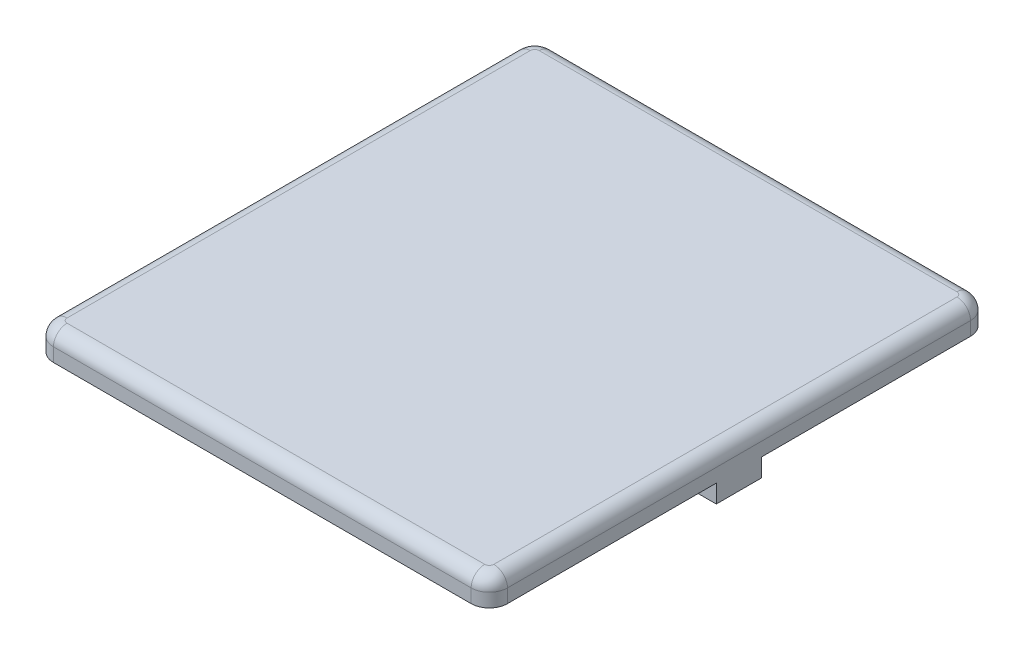
ISO-10303-21;
HEADER;
FILE_DESCRIPTION(('STEP AP214'),'2;1');
FILE_NAME('part.step','',(''),(''),'','','');
FILE_SCHEMA(('AUTOMOTIVE_DESIGN { 1 0 10303 214 1 1 1 1 }'));
ENDSEC;
DATA;
#1=APPLICATION_CONTEXT('core data for automotive mechanical design processes');
#2=APPLICATION_PROTOCOL_DEFINITION('international standard','automotive_design',2000,#1);
#3=PRODUCT_CONTEXT('',#1,'mechanical');
#4=PRODUCT('Part','Part','',(#3));
#5=PRODUCT_RELATED_PRODUCT_CATEGORY('part','',(#4));
#6=PRODUCT_DEFINITION_FORMATION('','',#4);
#7=PRODUCT_DEFINITION_CONTEXT('part definition',#1,'design');
#8=PRODUCT_DEFINITION('design','',#6,#7);
#9=PRODUCT_DEFINITION_SHAPE('','',#8);
#10=(LENGTH_UNIT() NAMED_UNIT(*) SI_UNIT(.MILLI.,.METRE.));
#11=(NAMED_UNIT(*) PLANE_ANGLE_UNIT() SI_UNIT($,.RADIAN.));
#12=(NAMED_UNIT(*) SI_UNIT($,.STERADIAN.) SOLID_ANGLE_UNIT());
#13=UNCERTAINTY_MEASURE_WITH_UNIT(LENGTH_MEASURE(1.E-05),#10,'distance_accuracy_value','');
#14=(GEOMETRIC_REPRESENTATION_CONTEXT(3) GLOBAL_UNCERTAINTY_ASSIGNED_CONTEXT((#13)) GLOBAL_UNIT_ASSIGNED_CONTEXT((#10,
#11,#12)) REPRESENTATION_CONTEXT('',''));
#15=CARTESIAN_POINT('',(0.,0.,0.));
#16=DIRECTION('',(0.,0.,1.));
#17=DIRECTION('',(1.,0.,0.));
#18=AXIS2_PLACEMENT_3D('',#15,#16,#17);
#19=CARTESIAN_POINT('',(0.,-2.,-2.5));
#20=DIRECTION('',(0.,0.,1.));
#21=DIRECTION('',(1.,0.,0.));
#22=AXIS2_PLACEMENT_3D('',#19,#20,#21);
#23=PLANE('',#22);
#24=DIRECTION('',(0.,1.,0.));
#25=VECTOR('',#24,1.);
#26=CARTESIAN_POINT('',(31.,-5.,-2.5));
#27=LINE('',#26,#25);
#28=CARTESIAN_POINT('',(31.,0.,-2.5));
#29=VERTEX_POINT('',#28);
#30=CARTESIAN_POINT('',(31.,-2.,-2.5));
#31=VERTEX_POINT('',#30);
#32=EDGE_CURVE('E57',#29,#31,#27,.F.);
#33=ORIENTED_EDGE('',*,*,#32,.F.);
#34=DIRECTION('',(1.,0.,0.));
#35=VECTOR('',#34,1.);
#36=CARTESIAN_POINT('',(0.,0.,-2.5));
#37=LINE('',#36,#35);
#38=CARTESIAN_POINT('',(50.,0.,-2.5));
#39=VERTEX_POINT('',#38);
#40=EDGE_CURVE('E192',#29,#39,#37,.T.);
#41=ORIENTED_EDGE('',*,*,#40,.T.);
#42=DIRECTION('',(0.,1.,0.));
#43=VECTOR('',#42,1.);
#44=CARTESIAN_POINT('',(50.,-2.,-2.5));
#45=LINE('',#44,#43);
#46=CARTESIAN_POINT('',(50.,-2.,-2.5));
#47=VERTEX_POINT('',#46);
#48=EDGE_CURVE('E218',#47,#39,#45,.T.);
#49=ORIENTED_EDGE('',*,*,#48,.F.);
#50=DIRECTION('',(1.,0.,0.));
#51=VECTOR('',#50,1.);
#52=CARTESIAN_POINT('',(0.,-2.,-2.5));
#53=LINE('',#52,#51);
#54=EDGE_CURVE('E194',#31,#47,#53,.T.);
#55=ORIENTED_EDGE('',*,*,#54,.F.);
#56=EDGE_LOOP('',(#33,#41,#49,#55));
#57=FACE_BOUND('',#56,.T.);
#58=ADVANCED_FACE('F42',(#57),#23,.F.);
#59=DIRECTION('',(0.,1.,0.));
#60=VECTOR('',#59,1.);
#61=CARTESIAN_POINT('',(19.,-5.,-2.5));
#62=LINE('',#61,#60);
#63=CARTESIAN_POINT('',(19.,-2.,-2.5));
#64=VERTEX_POINT('',#63);
#65=CARTESIAN_POINT('',(19.,0.,-2.5));
#66=VERTEX_POINT('',#65);
#67=EDGE_CURVE('E182',#64,#66,#62,.T.);
#68=ORIENTED_EDGE('',*,*,#67,.F.);
#69=CARTESIAN_POINT('',(0.,-2.,-2.5));
#70=VERTEX_POINT('',#69);
#71=EDGE_CURVE('E350',#70,#64,#53,.T.);
#72=ORIENTED_EDGE('',*,*,#71,.F.);
#73=DIRECTION('',(0.,1.,0.));
#74=VECTOR('',#73,1.);
#75=CARTESIAN_POINT('',(0.,-2.,-2.5));
#76=LINE('',#75,#74);
#77=CARTESIAN_POINT('',(0.,0.,-2.5));
#78=VERTEX_POINT('',#77);
#79=EDGE_CURVE('E220',#70,#78,#76,.T.);
#80=ORIENTED_EDGE('',*,*,#79,.T.);
#81=EDGE_CURVE('E202',#78,#66,#37,.T.);
#82=ORIENTED_EDGE('',*,*,#81,.T.);
#83=EDGE_LOOP('',(#68,#72,#80,#82));
#84=FACE_BOUND('',#83,.T.);
#85=ADVANCED_FACE('F377',(#84),#23,.F.);
#86=CARTESIAN_POINT('',(0.,-2.,2.5));
#87=DIRECTION('',(0.,0.,-1.));
#88=DIRECTION('',(-1.,0.,0.));
#89=AXIS2_PLACEMENT_3D('',#86,#87,#88);
#90=PLANE('',#89);
#91=DIRECTION('',(0.,1.,0.));
#92=VECTOR('',#91,1.);
#93=CARTESIAN_POINT('',(19.,-5.,2.5));
#94=LINE('',#93,#92);
#95=CARTESIAN_POINT('',(19.,0.,2.5));
#96=VERTEX_POINT('',#95);
#97=CARTESIAN_POINT('',(19.,-2.,2.5));
#98=VERTEX_POINT('',#97);
#99=EDGE_CURVE('E195',#96,#98,#94,.F.);
#100=ORIENTED_EDGE('',*,*,#99,.F.);
#101=DIRECTION('',(-1.,0.,0.));
#102=VECTOR('',#101,1.);
#103=CARTESIAN_POINT('',(0.,0.,2.5));
#104=LINE('',#103,#102);
#105=CARTESIAN_POINT('',(0.,0.,2.5));
#106=VERTEX_POINT('',#105);
#107=EDGE_CURVE('E204',#96,#106,#104,.T.);
#108=ORIENTED_EDGE('',*,*,#107,.T.);
#109=DIRECTION('',(0.,1.,0.));
#110=VECTOR('',#109,1.);
#111=CARTESIAN_POINT('',(0.,-2.,2.5));
#112=LINE('',#111,#110);
#113=CARTESIAN_POINT('',(0.,-2.,2.5));
#114=VERTEX_POINT('',#113);
#115=EDGE_CURVE('E212',#114,#106,#112,.T.);
#116=ORIENTED_EDGE('',*,*,#115,.F.);
#117=DIRECTION('',(-1.,0.,0.));
#118=VECTOR('',#117,1.);
#119=CARTESIAN_POINT('',(0.,-2.,2.5));
#120=LINE('',#119,#118);
#121=EDGE_CURVE('E353',#98,#114,#120,.T.);
#122=ORIENTED_EDGE('',*,*,#121,.F.);
#123=EDGE_LOOP('',(#100,#108,#116,#122));
#124=FACE_BOUND('',#123,.T.);
#125=ADVANCED_FACE('F372',(#124),#90,.F.);
#126=DIRECTION('',(0.,1.,0.));
#127=VECTOR('',#126,1.);
#128=CARTESIAN_POINT('',(31.,-5.,2.5));
#129=LINE('',#128,#127);
#130=CARTESIAN_POINT('',(31.,-2.,2.5));
#131=VERTEX_POINT('',#130);
#132=CARTESIAN_POINT('',(31.,0.,2.5));
#133=VERTEX_POINT('',#132);
#134=EDGE_CURVE('E196',#131,#133,#129,.T.);
#135=ORIENTED_EDGE('',*,*,#134,.F.);
#136=CARTESIAN_POINT('',(50.,-2.,2.5));
#137=VERTEX_POINT('',#136);
#138=EDGE_CURVE('E208',#137,#131,#120,.T.);
#139=ORIENTED_EDGE('',*,*,#138,.F.);
#140=DIRECTION('',(0.,1.,0.));
#141=VECTOR('',#140,1.);
#142=CARTESIAN_POINT('',(50.,-2.,2.5));
#143=LINE('',#142,#141);
#144=CARTESIAN_POINT('',(50.,0.,2.5));
#145=VERTEX_POINT('',#144);
#146=EDGE_CURVE('E215',#137,#145,#143,.T.);
#147=ORIENTED_EDGE('',*,*,#146,.T.);
#148=EDGE_CURVE('E65',#145,#133,#104,.T.);
#149=ORIENTED_EDGE('',*,*,#148,.T.);
#150=EDGE_LOOP('',(#135,#139,#147,#149));
#151=FACE_BOUND('',#150,.T.);
#152=ADVANCED_FACE('F366',(#151),#90,.F.);
#153=CARTESIAN_POINT('',(0.,-2.,0.));
#154=DIRECTION('',(0.,-1.,0.));
#155=DIRECTION('',(0.,0.,-1.));
#156=AXIS2_PLACEMENT_3D('',#153,#154,#155);
#157=PLANE('',#156);
#158=ORIENTED_EDGE('',*,*,#71,.T.);
#159=CARTESIAN_POINT('',(25.,-2.,0.));
#160=DIRECTION('',(0.,-1.,0.));
#161=DIRECTION('',(0.,0.,-1.));
#162=AXIS2_PLACEMENT_3D('',#159,#160,#161);
#163=CIRCLE('',#162,6.5);
#164=EDGE_CURVE('E322',#64,#98,#163,.F.);
#165=ORIENTED_EDGE('',*,*,#164,.T.);
#166=ORIENTED_EDGE('',*,*,#121,.T.);
#167=DIRECTION('',(0.,0.,-1.));
#168=VECTOR('',#167,1.);
#169=CARTESIAN_POINT('',(0.,-2.,2.5));
#170=LINE('',#169,#168);
#171=EDGE_CURVE('E211',#114,#70,#170,.T.);
#172=ORIENTED_EDGE('',*,*,#171,.T.);
#173=EDGE_LOOP('',(#158,#165,#166,#172));
#174=FACE_BOUND('',#173,.T.);
#175=ADVANCED_FACE('F374',(#174),#157,.T.);
#176=CARTESIAN_POINT('',(0.,0.,27.5));
#177=DIRECTION('',(0.,1.,0.));
#178=DIRECTION('',(0.,0.,1.));
#179=AXIS2_PLACEMENT_3D('',#176,#177,#178);
#180=PLANE('',#179);
#181=CARTESIAN_POINT('',(25.,0.,0.));
#182=DIRECTION('',(0.,-1.,0.));
#183=DIRECTION('',(0.,0.,-1.));
#184=AXIS2_PLACEMENT_3D('',#181,#182,#183);
#185=CIRCLE('',#184,6.5);
#186=EDGE_CURVE('E186',#133,#96,#185,.T.);
#187=ORIENTED_EDGE('',*,*,#186,.F.);
#188=ORIENTED_EDGE('',*,*,#148,.F.);
#189=DIRECTION('',(0.,0.,-1.));
#190=VECTOR('',#189,1.);
#191=CARTESIAN_POINT('',(50.,0.,27.5));
#192=LINE('',#191,#190);
#193=CARTESIAN_POINT('',(50.,0.,25.5));
#194=VERTEX_POINT('',#193);
#195=EDGE_CURVE('E231',#194,#145,#192,.T.);
#196=ORIENTED_EDGE('',*,*,#195,.F.);
#197=CARTESIAN_POINT('',(48.,0.,25.5));
#198=DIRECTION('',(0.,1.,0.));
#199=DIRECTION('',(0.,0.,1.));
#200=AXIS2_PLACEMENT_3D('',#197,#198,#199);
#201=CIRCLE('',#200,2.);
#202=CARTESIAN_POINT('',(48.,0.,27.5));
#203=VERTEX_POINT('',#202);
#204=EDGE_CURVE('E245',#194,#203,#201,.F.);
#205=ORIENTED_EDGE('',*,*,#204,.T.);
#206=DIRECTION('',(1.,0.,0.));
#207=VECTOR('',#206,1.);
#208=CARTESIAN_POINT('',(0.,0.,27.5));
#209=LINE('',#208,#207);
#210=CARTESIAN_POINT('',(2.,0.,27.5));
#211=VERTEX_POINT('',#210);
#212=EDGE_CURVE('E224',#211,#203,#209,.T.);
#213=ORIENTED_EDGE('',*,*,#212,.F.);
#214=CARTESIAN_POINT('',(2.,0.,25.5));
#215=DIRECTION('',(0.,1.,0.));
#216=DIRECTION('',(0.,0.,1.));
#217=AXIS2_PLACEMENT_3D('',#214,#215,#216);
#218=CIRCLE('',#217,2.);
#219=CARTESIAN_POINT('',(0.,0.,25.5));
#220=VERTEX_POINT('',#219);
#221=EDGE_CURVE('E243',#211,#220,#218,.F.);
#222=ORIENTED_EDGE('',*,*,#221,.T.);
#223=DIRECTION('',(0.,0.,-1.));
#224=VECTOR('',#223,1.);
#225=CARTESIAN_POINT('',(0.,0.,27.5));
#226=LINE('',#225,#224);
#227=EDGE_CURVE('E234',#220,#106,#226,.T.);
#228=ORIENTED_EDGE('',*,*,#227,.T.);
#229=ORIENTED_EDGE('',*,*,#107,.F.);
#230=EDGE_LOOP('',(#187,#188,#196,#205,#213,#222,#228,#229));
#231=FACE_BOUND('',#230,.T.);
#232=ADVANCED_FACE('F369',(#231),#180,.F.);
#233=EDGE_CURVE('E179',#66,#29,#185,.T.);
#234=ORIENTED_EDGE('',*,*,#233,.F.);
#235=ORIENTED_EDGE('',*,*,#81,.F.);
#236=CARTESIAN_POINT('',(0.,0.,-25.5));
#237=VERTEX_POINT('',#236);
#238=EDGE_CURVE('E233',#78,#237,#226,.T.);
#239=ORIENTED_EDGE('',*,*,#238,.T.);
#240=CARTESIAN_POINT('',(2.,0.,-25.5));
#241=DIRECTION('',(0.,1.,0.));
#242=DIRECTION('',(0.,0.,1.));
#243=AXIS2_PLACEMENT_3D('',#240,#241,#242);
#244=CIRCLE('',#243,2.);
#245=CARTESIAN_POINT('',(2.,0.,-27.5));
#246=VERTEX_POINT('',#245);
#247=EDGE_CURVE('E249',#237,#246,#244,.F.);
#248=ORIENTED_EDGE('',*,*,#247,.T.);
#249=DIRECTION('',(1.,0.,0.));
#250=VECTOR('',#249,1.);
#251=CARTESIAN_POINT('',(0.,0.,-27.5));
#252=LINE('',#251,#250);
#253=CARTESIAN_POINT('',(48.,0.,-27.5));
#254=VERTEX_POINT('',#253);
#255=EDGE_CURVE('E227',#246,#254,#252,.T.);
#256=ORIENTED_EDGE('',*,*,#255,.T.);
#257=CARTESIAN_POINT('',(48.,0.,-25.5));
#258=DIRECTION('',(0.,1.,0.));
#259=DIRECTION('',(0.,0.,1.));
#260=AXIS2_PLACEMENT_3D('',#257,#258,#259);
#261=CIRCLE('',#260,2.);
#262=CARTESIAN_POINT('',(50.,0.,-25.5));
#263=VERTEX_POINT('',#262);
#264=EDGE_CURVE('E247',#254,#263,#261,.F.);
#265=ORIENTED_EDGE('',*,*,#264,.T.);
#266=EDGE_CURVE('E200',#39,#263,#192,.T.);
#267=ORIENTED_EDGE('',*,*,#266,.F.);
#268=ORIENTED_EDGE('',*,*,#40,.F.);
#269=EDGE_LOOP('',(#234,#235,#239,#248,#256,#265,#267,#268));
#270=FACE_BOUND('',#269,.T.);
#271=ADVANCED_FACE('F198',(#270),#180,.F.);
#272=CARTESIAN_POINT('',(0.,0.,27.5));
#273=DIRECTION('',(1.,0.,0.));
#274=DIRECTION('',(0.,0.,-1.));
#275=AXIS2_PLACEMENT_3D('',#272,#273,#274);
#276=PLANE('',#275);
#277=DIRECTION('',(0.,-1.,0.));
#278=VECTOR('',#277,1.);
#279=CARTESIAN_POINT('',(0.,0.,25.5));
#280=LINE('',#279,#278);
#281=CARTESIAN_POINT('',(0.,1.5,25.5));
#282=VERTEX_POINT('',#281);
#283=EDGE_CURVE('E237',#220,#282,#280,.F.);
#284=ORIENTED_EDGE('',*,*,#283,.T.);
#285=DIRECTION('',(0.,0.,-1.));
#286=VECTOR('',#285,1.);
#287=CARTESIAN_POINT('',(0.,1.5,27.5));
#288=LINE('',#287,#286);
#289=CARTESIAN_POINT('',(0.,1.5,-25.5));
#290=VERTEX_POINT('',#289);
#291=EDGE_CURVE('E294',#282,#290,#288,.T.);
#292=ORIENTED_EDGE('',*,*,#291,.T.);
#293=DIRECTION('',(0.,-1.,0.));
#294=VECTOR('',#293,1.);
#295=CARTESIAN_POINT('',(0.,0.,-25.5));
#296=LINE('',#295,#294);
#297=EDGE_CURVE('E240',#290,#237,#296,.T.);
#298=ORIENTED_EDGE('',*,*,#297,.T.);
#299=ORIENTED_EDGE('',*,*,#238,.F.);
#300=ORIENTED_EDGE('',*,*,#79,.F.);
#301=ORIENTED_EDGE('',*,*,#171,.F.);
#302=ORIENTED_EDGE('',*,*,#115,.T.);
#303=ORIENTED_EDGE('',*,*,#227,.F.);
#304=EDGE_LOOP('',(#284,#292,#298,#299,#300,#301,#302,#303));
#305=FACE_BOUND('',#304,.T.);
#306=ADVANCED_FACE('F380',(#305),#276,.F.);
#307=CARTESIAN_POINT('',(50.,0.,27.5));
#308=DIRECTION('',(-1.,0.,0.));
#309=DIRECTION('',(0.,0.,1.));
#310=AXIS2_PLACEMENT_3D('',#307,#308,#309);
#311=PLANE('',#310);
#312=DIRECTION('',(0.,1.,0.));
#313=VECTOR('',#312,1.);
#314=CARTESIAN_POINT('',(50.,3.,-25.5));
#315=LINE('',#314,#313);
#316=CARTESIAN_POINT('',(50.,1.5,-25.5));
#317=VERTEX_POINT('',#316);
#318=EDGE_CURVE('E258',#263,#317,#315,.T.);
#319=ORIENTED_EDGE('',*,*,#318,.T.);
#320=DIRECTION('',(0.,0.,-1.));
#321=VECTOR('',#320,1.);
#322=CARTESIAN_POINT('',(50.,1.5,27.5));
#323=LINE('',#322,#321);
#324=CARTESIAN_POINT('',(50.,1.5,25.5));
#325=VERTEX_POINT('',#324);
#326=EDGE_CURVE('E286',#317,#325,#323,.F.);
#327=ORIENTED_EDGE('',*,*,#326,.T.);
#328=DIRECTION('',(0.,1.,0.));
#329=VECTOR('',#328,1.);
#330=CARTESIAN_POINT('',(50.,0.,25.5));
#331=LINE('',#330,#329);
#332=EDGE_CURVE('E256',#325,#194,#331,.F.);
#333=ORIENTED_EDGE('',*,*,#332,.T.);
#334=ORIENTED_EDGE('',*,*,#195,.T.);
#335=ORIENTED_EDGE('',*,*,#146,.F.);
#336=DIRECTION('',(0.,0.,1.));
#337=VECTOR('',#336,1.);
#338=CARTESIAN_POINT('',(50.,-2.,2.5));
#339=LINE('',#338,#337);
#340=EDGE_CURVE('E352',#47,#137,#339,.T.);
#341=ORIENTED_EDGE('',*,*,#340,.F.);
#342=ORIENTED_EDGE('',*,*,#48,.T.);
#343=ORIENTED_EDGE('',*,*,#266,.T.);
#344=EDGE_LOOP('',(#319,#327,#333,#334,#335,#341,#342,#343));
#345=FACE_BOUND('',#344,.T.);
#346=ADVANCED_FACE('F418',(#345),#311,.F.);
#347=CARTESIAN_POINT('',(0.,3.,27.5));
#348=DIRECTION('',(0.,-1.,0.));
#349=DIRECTION('',(0.,0.,-1.));
#350=AXIS2_PLACEMENT_3D('',#347,#348,#349);
#351=PLANE('',#350);
#352=DIRECTION('',(0.,0.,-1.));
#353=VECTOR('',#352,1.);
#354=CARTESIAN_POINT('',(48.5,3.,27.5));
#355=LINE('',#354,#353);
#356=CARTESIAN_POINT('',(48.5,3.,25.5));
#357=VERTEX_POINT('',#356);
#358=CARTESIAN_POINT('',(48.5,3.,-25.5));
#359=VERTEX_POINT('',#358);
#360=EDGE_CURVE('E278',#357,#359,#355,.T.);
#361=ORIENTED_EDGE('',*,*,#360,.T.);
#362=CARTESIAN_POINT('',(48.,3.,-25.5));
#363=DIRECTION('',(0.,-1.,0.));
#364=DIRECTION('',(0.,0.,-1.));
#365=AXIS2_PLACEMENT_3D('',#362,#363,#364);
#366=CIRCLE('',#365,0.5);
#367=CARTESIAN_POINT('',(48.,3.,-26.));
#368=VERTEX_POINT('',#367);
#369=EDGE_CURVE('E280',#359,#368,#366,.F.);
#370=ORIENTED_EDGE('',*,*,#369,.T.);
#371=DIRECTION('',(-1.,0.,0.));
#372=VECTOR('',#371,1.);
#373=CARTESIAN_POINT('',(2.,3.,-26.));
#374=LINE('',#373,#372);
#375=CARTESIAN_POINT('',(2.,3.,-26.));
#376=VERTEX_POINT('',#375);
#377=EDGE_CURVE('E266',#368,#376,#374,.T.);
#378=ORIENTED_EDGE('',*,*,#377,.T.);
#379=CARTESIAN_POINT('',(2.,3.,-25.5));
#380=DIRECTION('',(0.,-1.,0.));
#381=DIRECTION('',(0.,0.,-1.));
#382=AXIS2_PLACEMENT_3D('',#379,#380,#381);
#383=CIRCLE('',#382,0.5);
#384=CARTESIAN_POINT('',(1.5,3.,-25.5));
#385=VERTEX_POINT('',#384);
#386=EDGE_CURVE('E268',#376,#385,#383,.F.);
#387=ORIENTED_EDGE('',*,*,#386,.T.);
#388=DIRECTION('',(0.,0.,-1.));
#389=VECTOR('',#388,1.);
#390=CARTESIAN_POINT('',(1.5,3.,27.5));
#391=LINE('',#390,#389);
#392=CARTESIAN_POINT('',(1.5,3.,25.5));
#393=VERTEX_POINT('',#392);
#394=EDGE_CURVE('E270',#385,#393,#391,.F.);
#395=ORIENTED_EDGE('',*,*,#394,.T.);
#396=CARTESIAN_POINT('',(2.,3.,25.5));
#397=DIRECTION('',(0.,-1.,0.));
#398=DIRECTION('',(0.,0.,-1.));
#399=AXIS2_PLACEMENT_3D('',#396,#397,#398);
#400=CIRCLE('',#399,0.5);
#401=CARTESIAN_POINT('',(2.,3.,26.));
#402=VERTEX_POINT('',#401);
#403=EDGE_CURVE('E272',#393,#402,#400,.F.);
#404=ORIENTED_EDGE('',*,*,#403,.T.);
#405=DIRECTION('',(-1.,0.,0.));
#406=VECTOR('',#405,1.);
#407=CARTESIAN_POINT('',(0.,3.,26.));
#408=LINE('',#407,#406);
#409=CARTESIAN_POINT('',(48.,3.,26.));
#410=VERTEX_POINT('',#409);
#411=EDGE_CURVE('E274',#402,#410,#408,.F.);
#412=ORIENTED_EDGE('',*,*,#411,.T.);
#413=CARTESIAN_POINT('',(48.,3.,25.5));
#414=DIRECTION('',(0.,-1.,0.));
#415=DIRECTION('',(0.,0.,-1.));
#416=AXIS2_PLACEMENT_3D('',#413,#414,#415);
#417=CIRCLE('',#416,0.5);
#418=EDGE_CURVE('E276',#410,#357,#417,.F.);
#419=ORIENTED_EDGE('',*,*,#418,.T.);
#420=EDGE_LOOP('',(#361,#370,#378,#387,#395,#404,#412,#419));
#421=FACE_BOUND('',#420,.T.);
#422=ADVANCED_FACE('F410',(#421),#351,.F.);
#423=CARTESIAN_POINT('',(0.,0.,27.5));
#424=DIRECTION('',(0.,0.,-1.));
#425=DIRECTION('',(-1.,0.,0.));
#426=AXIS2_PLACEMENT_3D('',#423,#424,#425);
#427=PLANE('',#426);
#428=DIRECTION('',(0.,1.,0.));
#429=VECTOR('',#428,1.);
#430=CARTESIAN_POINT('',(48.,0.,27.5));
#431=LINE('',#430,#429);
#432=CARTESIAN_POINT('',(48.,1.5,27.5));
#433=VERTEX_POINT('',#432);
#434=EDGE_CURVE('E263',#203,#433,#431,.T.);
#435=ORIENTED_EDGE('',*,*,#434,.T.);
#436=DIRECTION('',(-1.,0.,0.));
#437=VECTOR('',#436,1.);
#438=CARTESIAN_POINT('',(0.,1.5,27.5));
#439=LINE('',#438,#437);
#440=CARTESIAN_POINT('',(2.,1.5,27.5));
#441=VERTEX_POINT('',#440);
#442=EDGE_CURVE('E290',#433,#441,#439,.T.);
#443=ORIENTED_EDGE('',*,*,#442,.T.);
#444=DIRECTION('',(0.,-1.,0.));
#445=VECTOR('',#444,1.);
#446=CARTESIAN_POINT('',(2.,0.,27.5));
#447=LINE('',#446,#445);
#448=EDGE_CURVE('E261',#441,#211,#447,.T.);
#449=ORIENTED_EDGE('',*,*,#448,.T.);
#450=ORIENTED_EDGE('',*,*,#212,.T.);
#451=EDGE_LOOP('',(#435,#443,#449,#450));
#452=FACE_BOUND('',#451,.T.);
#453=ADVANCED_FACE('F434',(#452),#427,.F.);
#454=CARTESIAN_POINT('',(0.,0.,-27.5));
#455=DIRECTION('',(0.,0.,-1.));
#456=DIRECTION('',(-1.,0.,0.));
#457=AXIS2_PLACEMENT_3D('',#454,#455,#456);
#458=PLANE('',#457);
#459=DIRECTION('',(0.,-1.,0.));
#460=VECTOR('',#459,1.);
#461=CARTESIAN_POINT('',(2.,3.,-27.5));
#462=LINE('',#461,#460);
#463=CARTESIAN_POINT('',(2.,1.5,-27.5));
#464=VERTEX_POINT('',#463);
#465=EDGE_CURVE('E253',#246,#464,#462,.F.);
#466=ORIENTED_EDGE('',*,*,#465,.T.);
#467=DIRECTION('',(-1.,0.,0.));
#468=VECTOR('',#467,1.);
#469=CARTESIAN_POINT('',(48.,1.5,-27.5));
#470=LINE('',#469,#468);
#471=CARTESIAN_POINT('',(48.,1.5,-27.5));
#472=VERTEX_POINT('',#471);
#473=EDGE_CURVE('E298',#464,#472,#470,.F.);
#474=ORIENTED_EDGE('',*,*,#473,.T.);
#475=DIRECTION('',(0.,1.,0.));
#476=VECTOR('',#475,1.);
#477=CARTESIAN_POINT('',(48.,0.,-27.5));
#478=LINE('',#477,#476);
#479=EDGE_CURVE('E251',#472,#254,#478,.F.);
#480=ORIENTED_EDGE('',*,*,#479,.T.);
#481=ORIENTED_EDGE('',*,*,#255,.F.);
#482=EDGE_LOOP('',(#466,#474,#480,#481));
#483=FACE_BOUND('',#482,.T.);
#484=ADVANCED_FACE('F391',(#483),#458,.T.);
#485=CARTESIAN_POINT('',(2.,0.,-25.5));
#486=DIRECTION('',(0.,1.,0.));
#487=DIRECTION('',(0.,0.,1.));
#488=AXIS2_PLACEMENT_3D('',#485,#486,#487);
#489=CYLINDRICAL_SURFACE('',#488,2.);
#490=ORIENTED_EDGE('',*,*,#297,.F.);
#491=CARTESIAN_POINT('',(2.,1.5,-25.5));
#492=DIRECTION('',(0.,-1.,0.));
#493=DIRECTION('',(0.,0.,-1.));
#494=AXIS2_PLACEMENT_3D('',#491,#492,#493);
#495=CIRCLE('',#494,2.);
#496=EDGE_CURVE('E296',#290,#464,#495,.T.);
#497=ORIENTED_EDGE('',*,*,#496,.T.);
#498=ORIENTED_EDGE('',*,*,#465,.F.);
#499=ORIENTED_EDGE('',*,*,#247,.F.);
#500=EDGE_LOOP('',(#490,#497,#498,#499));
#501=FACE_BOUND('',#500,.T.);
#502=ADVANCED_FACE('F387',(#501),#489,.T.);
#503=CARTESIAN_POINT('',(48.,0.,-25.5));
#504=DIRECTION('',(0.,-1.,0.));
#505=DIRECTION('',(0.,0.,-1.));
#506=AXIS2_PLACEMENT_3D('',#503,#504,#505);
#507=CYLINDRICAL_SURFACE('',#506,2.);
#508=ORIENTED_EDGE('',*,*,#479,.F.);
#509=CARTESIAN_POINT('',(48.,1.5,-25.5));
#510=DIRECTION('',(0.,-1.,0.));
#511=DIRECTION('',(0.,0.,-1.));
#512=AXIS2_PLACEMENT_3D('',#509,#510,#511);
#513=CIRCLE('',#512,2.);
#514=EDGE_CURVE('E283',#472,#317,#513,.T.);
#515=ORIENTED_EDGE('',*,*,#514,.T.);
#516=ORIENTED_EDGE('',*,*,#318,.F.);
#517=ORIENTED_EDGE('',*,*,#264,.F.);
#518=EDGE_LOOP('',(#508,#515,#516,#517));
#519=FACE_BOUND('',#518,.T.);
#520=ADVANCED_FACE('F397',(#519),#507,.T.);
#521=CARTESIAN_POINT('',(48.,0.,25.5));
#522=DIRECTION('',(0.,1.,0.));
#523=DIRECTION('',(0.,0.,1.));
#524=AXIS2_PLACEMENT_3D('',#521,#522,#523);
#525=CYLINDRICAL_SURFACE('',#524,2.);
#526=ORIENTED_EDGE('',*,*,#332,.F.);
#527=CARTESIAN_POINT('',(48.,1.5,25.5));
#528=DIRECTION('',(0.,-1.,0.));
#529=DIRECTION('',(0.,0.,-1.));
#530=AXIS2_PLACEMENT_3D('',#527,#528,#529);
#531=CIRCLE('',#530,2.);
#532=EDGE_CURVE('E288',#325,#433,#531,.T.);
#533=ORIENTED_EDGE('',*,*,#532,.T.);
#534=ORIENTED_EDGE('',*,*,#434,.F.);
#535=ORIENTED_EDGE('',*,*,#204,.F.);
#536=EDGE_LOOP('',(#526,#533,#534,#535));
#537=FACE_BOUND('',#536,.T.);
#538=ADVANCED_FACE('F422',(#537),#525,.T.);
#539=CARTESIAN_POINT('',(2.,0.,25.5));
#540=DIRECTION('',(0.,-1.,0.));
#541=DIRECTION('',(0.,0.,-1.));
#542=AXIS2_PLACEMENT_3D('',#539,#540,#541);
#543=CYLINDRICAL_SURFACE('',#542,2.);
#544=ORIENTED_EDGE('',*,*,#448,.F.);
#545=CARTESIAN_POINT('',(2.,1.5,25.5));
#546=DIRECTION('',(0.,-1.,0.));
#547=DIRECTION('',(0.,0.,-1.));
#548=AXIS2_PLACEMENT_3D('',#545,#546,#547);
#549=CIRCLE('',#548,2.);
#550=EDGE_CURVE('E292',#441,#282,#549,.T.);
#551=ORIENTED_EDGE('',*,*,#550,.T.);
#552=ORIENTED_EDGE('',*,*,#283,.F.);
#553=ORIENTED_EDGE('',*,*,#221,.F.);
#554=EDGE_LOOP('',(#544,#551,#552,#553));
#555=FACE_BOUND('',#554,.T.);
#556=ADVANCED_FACE('F438',(#555),#543,.T.);
#557=CARTESIAN_POINT('',(2.,1.5,25.5));
#558=DIRECTION('',(0.,-1.,0.));
#559=DIRECTION('',(0.,0.,-1.));
#560=AXIS2_PLACEMENT_3D('',#557,#558,#559);
#561=DEGENERATE_TOROIDAL_SURFACE('',#560,0.5,1.5,.T.);
#562=CARTESIAN_POINT('',(1.5,1.5,25.5));
#563=DIRECTION('',(0.,0.,-1.));
#564=DIRECTION('',(-1.,0.,0.));
#565=AXIS2_PLACEMENT_3D('',#562,#563,#564);
#566=CIRCLE('',#565,1.5);
#567=EDGE_CURVE('E316',#282,#393,#566,.T.);
#568=ORIENTED_EDGE('',*,*,#567,.F.);
#569=ORIENTED_EDGE('',*,*,#550,.F.);
#570=CARTESIAN_POINT('',(2.,1.5,26.));
#571=DIRECTION('',(1.,0.,0.));
#572=DIRECTION('',(0.,0.,-1.));
#573=AXIS2_PLACEMENT_3D('',#570,#571,#572);
#574=CIRCLE('',#573,1.5);
#575=EDGE_CURVE('E230',#402,#441,#574,.T.);
#576=ORIENTED_EDGE('',*,*,#575,.F.);
#577=ORIENTED_EDGE('',*,*,#403,.F.);
#578=EDGE_LOOP('',(#568,#569,#576,#577));
#579=FACE_BOUND('',#578,.T.);
#580=ADVANCED_FACE('F443',(#579),#561,.T.);
#581=CARTESIAN_POINT('',(0.,1.5,26.));
#582=DIRECTION('',(-1.,0.,0.));
#583=DIRECTION('',(0.,0.,1.));
#584=AXIS2_PLACEMENT_3D('',#581,#582,#583);
#585=CYLINDRICAL_SURFACE('',#584,1.5);
#586=ORIENTED_EDGE('',*,*,#575,.T.);
#587=ORIENTED_EDGE('',*,*,#442,.F.);
#588=CARTESIAN_POINT('',(48.,1.5,26.));
#589=DIRECTION('',(1.,0.,0.));
#590=DIRECTION('',(0.,0.,-1.));
#591=AXIS2_PLACEMENT_3D('',#588,#589,#590);
#592=CIRCLE('',#591,1.5);
#593=EDGE_CURVE('E313',#410,#433,#592,.T.);
#594=ORIENTED_EDGE('',*,*,#593,.F.);
#595=ORIENTED_EDGE('',*,*,#411,.F.);
#596=EDGE_LOOP('',(#586,#587,#594,#595));
#597=FACE_BOUND('',#596,.T.);
#598=ADVANCED_FACE('F430',(#597),#585,.T.);
#599=CARTESIAN_POINT('',(1.5,1.5,27.5));
#600=DIRECTION('',(0.,0.,-1.));
#601=DIRECTION('',(-1.,0.,0.));
#602=AXIS2_PLACEMENT_3D('',#599,#600,#601);
#603=CYLINDRICAL_SURFACE('',#602,1.5);
#604=ORIENTED_EDGE('',*,*,#567,.T.);
#605=ORIENTED_EDGE('',*,*,#394,.F.);
#606=CARTESIAN_POINT('',(1.5,1.5,-25.5));
#607=DIRECTION('',(0.,0.,-1.));
#608=DIRECTION('',(-1.,0.,0.));
#609=AXIS2_PLACEMENT_3D('',#606,#607,#608);
#610=CIRCLE('',#609,1.5);
#611=EDGE_CURVE('E310',#290,#385,#610,.T.);
#612=ORIENTED_EDGE('',*,*,#611,.F.);
#613=ORIENTED_EDGE('',*,*,#291,.F.);
#614=EDGE_LOOP('',(#604,#605,#612,#613));
#615=FACE_BOUND('',#614,.T.);
#616=ADVANCED_FACE('F447',(#615),#603,.T.);
#617=CARTESIAN_POINT('',(48.,1.5,25.5));
#618=DIRECTION('',(0.,-1.,0.));
#619=DIRECTION('',(0.,0.,-1.));
#620=AXIS2_PLACEMENT_3D('',#617,#618,#619);
#621=DEGENERATE_TOROIDAL_SURFACE('',#620,0.5,1.5,.T.);
#622=ORIENTED_EDGE('',*,*,#593,.T.);
#623=ORIENTED_EDGE('',*,*,#532,.F.);
#624=CARTESIAN_POINT('',(48.5,1.5,25.5));
#625=DIRECTION('',(0.,0.,-1.));
#626=DIRECTION('',(-1.,0.,0.));
#627=AXIS2_PLACEMENT_3D('',#624,#625,#626);
#628=CIRCLE('',#627,1.5);
#629=EDGE_CURVE('E307',#357,#325,#628,.T.);
#630=ORIENTED_EDGE('',*,*,#629,.F.);
#631=ORIENTED_EDGE('',*,*,#418,.F.);
#632=EDGE_LOOP('',(#622,#623,#630,#631));
#633=FACE_BOUND('',#632,.T.);
#634=ADVANCED_FACE('F425',(#633),#621,.T.);
#635=CARTESIAN_POINT('',(2.,1.5,-25.5));
#636=DIRECTION('',(0.,-1.,0.));
#637=DIRECTION('',(0.,0.,-1.));
#638=AXIS2_PLACEMENT_3D('',#635,#636,#637);
#639=DEGENERATE_TOROIDAL_SURFACE('',#638,0.5,1.5,.T.);
#640=ORIENTED_EDGE('',*,*,#611,.T.);
#641=ORIENTED_EDGE('',*,*,#386,.F.);
#642=CARTESIAN_POINT('',(2.,1.5,-26.));
#643=DIRECTION('',(1.,0.,0.));
#644=DIRECTION('',(0.,0.,-1.));
#645=AXIS2_PLACEMENT_3D('',#642,#643,#644);
#646=CIRCLE('',#645,1.5);
#647=EDGE_CURVE('E304',#464,#376,#646,.T.);
#648=ORIENTED_EDGE('',*,*,#647,.F.);
#649=ORIENTED_EDGE('',*,*,#496,.F.);
#650=EDGE_LOOP('',(#640,#641,#648,#649));
#651=FACE_BOUND('',#650,.T.);
#652=ADVANCED_FACE('F450',(#651),#639,.T.);
#653=CARTESIAN_POINT('',(48.5,1.5,27.5));
#654=DIRECTION('',(0.,0.,-1.));
#655=DIRECTION('',(-1.,0.,0.));
#656=AXIS2_PLACEMENT_3D('',#653,#654,#655);
#657=CYLINDRICAL_SURFACE('',#656,1.5);
#658=ORIENTED_EDGE('',*,*,#629,.T.);
#659=ORIENTED_EDGE('',*,*,#326,.F.);
#660=CARTESIAN_POINT('',(48.5,1.5,-25.5));
#661=DIRECTION('',(0.,0.,-1.));
#662=DIRECTION('',(-1.,0.,0.));
#663=AXIS2_PLACEMENT_3D('',#660,#661,#662);
#664=CIRCLE('',#663,1.5);
#665=EDGE_CURVE('E302',#359,#317,#664,.T.);
#666=ORIENTED_EDGE('',*,*,#665,.F.);
#667=ORIENTED_EDGE('',*,*,#360,.F.);
#668=EDGE_LOOP('',(#658,#659,#666,#667));
#669=FACE_BOUND('',#668,.T.);
#670=ADVANCED_FACE('F415',(#669),#657,.T.);
#671=CARTESIAN_POINT('',(0.,1.5,-26.));
#672=DIRECTION('',(1.,0.,0.));
#673=DIRECTION('',(0.,0.,-1.));
#674=AXIS2_PLACEMENT_3D('',#671,#672,#673);
#675=CYLINDRICAL_SURFACE('',#674,1.5);
#676=ORIENTED_EDGE('',*,*,#647,.T.);
#677=ORIENTED_EDGE('',*,*,#377,.F.);
#678=CARTESIAN_POINT('',(48.,1.5,-26.));
#679=DIRECTION('',(1.,0.,0.));
#680=DIRECTION('',(0.,0.,-1.));
#681=AXIS2_PLACEMENT_3D('',#678,#679,#680);
#682=CIRCLE('',#681,1.5);
#683=EDGE_CURVE('E223',#472,#368,#682,.T.);
#684=ORIENTED_EDGE('',*,*,#683,.F.);
#685=ORIENTED_EDGE('',*,*,#473,.F.);
#686=EDGE_LOOP('',(#676,#677,#684,#685));
#687=FACE_BOUND('',#686,.T.);
#688=ADVANCED_FACE('F407',(#687),#675,.T.);
#689=CARTESIAN_POINT('',(48.,1.5,-25.5));
#690=DIRECTION('',(0.,-1.,0.));
#691=DIRECTION('',(0.,0.,-1.));
#692=AXIS2_PLACEMENT_3D('',#689,#690,#691);
#693=DEGENERATE_TOROIDAL_SURFACE('',#692,0.5,1.5,.T.);
#694=ORIENTED_EDGE('',*,*,#665,.T.);
#695=ORIENTED_EDGE('',*,*,#514,.F.);
#696=ORIENTED_EDGE('',*,*,#683,.T.);
#697=ORIENTED_EDGE('',*,*,#369,.F.);
#698=EDGE_LOOP('',(#694,#695,#696,#697));
#699=FACE_BOUND('',#698,.T.);
#700=ADVANCED_FACE('F401',(#699),#693,.T.);
#701=ORIENTED_EDGE('',*,*,#138,.T.);
#702=EDGE_CURVE('E300',#131,#31,#163,.F.);
#703=ORIENTED_EDGE('',*,*,#702,.T.);
#704=ORIENTED_EDGE('',*,*,#54,.T.);
#705=ORIENTED_EDGE('',*,*,#340,.T.);
#706=EDGE_LOOP('',(#701,#703,#704,#705));
#707=FACE_BOUND('',#706,.T.);
#708=ADVANCED_FACE('F363',(#707),#157,.T.);
#709=CARTESIAN_POINT('',(25.,-5.,0.));
#710=DIRECTION('',(0.,1.,0.));
#711=DIRECTION('',(0.,0.,1.));
#712=AXIS2_PLACEMENT_3D('',#709,#710,#711);
#713=CYLINDRICAL_SURFACE('',#712,6.5);
#714=CARTESIAN_POINT('',(25.,-4.5,0.));
#715=DIRECTION('',(0.,-1.,0.));
#716=DIRECTION('',(0.,0.,-1.));
#717=AXIS2_PLACEMENT_3D('',#714,#715,#716);
#718=CIRCLE('',#717,6.5);
#719=CARTESIAN_POINT('',(25.,-4.5,-6.5));
#720=VERTEX_POINT('',#719);
#721=EDGE_CURVE('E12',#720,#720,#718,.F.);
#722=ORIENTED_EDGE('',*,*,#721,.T.);
#723=EDGE_LOOP('',(#722));
#724=FACE_BOUND('',#723,.T.);
#725=ORIENTED_EDGE('',*,*,#164,.F.);
#726=ORIENTED_EDGE('',*,*,#67,.T.);
#727=ORIENTED_EDGE('',*,*,#233,.T.);
#728=ORIENTED_EDGE('',*,*,#32,.T.);
#729=ORIENTED_EDGE('',*,*,#702,.F.);
#730=ORIENTED_EDGE('',*,*,#134,.T.);
#731=ORIENTED_EDGE('',*,*,#186,.T.);
#732=ORIENTED_EDGE('',*,*,#99,.T.);
#733=EDGE_LOOP('',(#725,#726,#727,#728,#729,#730,#731,#732));
#734=FACE_BOUND('',#733,.T.);
#735=ADVANCED_FACE('F180',(#724,#734),#713,.T.);
#736=CARTESIAN_POINT('',(25.,-5.,0.));
#737=DIRECTION('',(0.,-1.,0.));
#738=DIRECTION('',(0.,0.,-1.));
#739=AXIS2_PLACEMENT_3D('',#736,#737,#738);
#740=PLANE('',#739);
#741=CARTESIAN_POINT('',(25.,-5.,0.));
#742=DIRECTION('',(0.,-1.,0.));
#743=DIRECTION('',(0.,0.,-1.));
#744=AXIS2_PLACEMENT_3D('',#741,#742,#743);
#745=CIRCLE('',#744,5.5);
#746=CARTESIAN_POINT('',(25.,-5.,-5.5));
#747=VERTEX_POINT('',#746);
#748=EDGE_CURVE('E50',#747,#747,#745,.F.);
#749=ORIENTED_EDGE('',*,*,#748,.T.);
#750=EDGE_LOOP('',(#749));
#751=FACE_BOUND('',#750,.T.);
#752=CARTESIAN_POINT('',(25.,-5.,0.));
#753=DIRECTION('',(0.,-1.,0.));
#754=DIRECTION('',(0.,0.,-1.));
#755=AXIS2_PLACEMENT_3D('',#752,#753,#754);
#756=CIRCLE('',#755,6.);
#757=CARTESIAN_POINT('',(25.,-5.,-6.));
#758=VERTEX_POINT('',#757);
#759=EDGE_CURVE('E323',#758,#758,#756,.T.);
#760=ORIENTED_EDGE('',*,*,#759,.T.);
#761=EDGE_LOOP('',(#760));
#762=FACE_BOUND('',#761,.T.);
#763=ADVANCED_FACE('F328',(#751,#762),#740,.T.);
#764=CARTESIAN_POINT('',(25.,-3.07,0.));
#765=DIRECTION('',(0.,1.,0.));
#766=DIRECTION('',(-1.,0.,0.));
#767=AXIS2_PLACEMENT_3D('',#764,#765,#766);
#768=TOROIDAL_SURFACE('',#767,5.,1.43);
#769=CARTESIAN_POINT('',(25.,-1.64,0.));
#770=DIRECTION('',(0.,1.,0.));
#771=DIRECTION('',(-1.,0.,0.));
#772=AXIS2_PLACEMENT_3D('',#769,#770,#771);
#773=CIRCLE('',#772,5.);
#774=CARTESIAN_POINT('',(20.,-1.64,0.));
#775=VERTEX_POINT('',#774);
#776=EDGE_CURVE('E339',#775,#775,#773,.T.);
#777=ORIENTED_EDGE('',*,*,#776,.T.);
#778=EDGE_LOOP('',(#777));
#779=FACE_BOUND('',#778,.T.);
#780=CARTESIAN_POINT('',(25.,-4.5,0.));
#781=DIRECTION('',(0.,1.,0.));
#782=DIRECTION('',(-1.,0.,0.));
#783=AXIS2_PLACEMENT_3D('',#780,#781,#782);
#784=CIRCLE('',#783,5.);
#785=CARTESIAN_POINT('',(20.,-4.5,0.));
#786=VERTEX_POINT('',#785);
#787=EDGE_CURVE('E337',#786,#786,#784,.T.);
#788=ORIENTED_EDGE('',*,*,#787,.F.);
#789=EDGE_LOOP('',(#788));
#790=FACE_BOUND('',#789,.T.);
#791=ADVANCED_FACE('F521',(#779,#790),#768,.F.);
#792=CARTESIAN_POINT('',(25.,0.,0.));
#793=DIRECTION('',(0.,-1.,0.));
#794=DIRECTION('',(1.,0.,0.));
#795=AXIS2_PLACEMENT_3D('',#792,#793,#794);
#796=CIRCLE('',#795,5.);
#797=CARTESIAN_POINT('',(30.,0.,0.));
#798=VERTEX_POINT('',#797);
#799=EDGE_CURVE('E187',#798,#798,#796,.T.);
#800=ORIENTED_EDGE('',*,*,#799,.T.);
#801=EDGE_LOOP('',(#800));
#802=FACE_BOUND('',#801,.T.);
#803=ADVANCED_FACE('F477',(#802),#180,.F.);
#804=CARTESIAN_POINT('',(25.,-5.,0.));
#805=DIRECTION('',(0.,1.,0.));
#806=DIRECTION('',(0.,0.,1.));
#807=AXIS2_PLACEMENT_3D('',#804,#805,#806);
#808=CYLINDRICAL_SURFACE('',#807,5.);
#809=ORIENTED_EDGE('',*,*,#799,.F.);
#810=EDGE_LOOP('',(#809));
#811=FACE_BOUND('',#810,.T.);
#812=ORIENTED_EDGE('',*,*,#776,.F.);
#813=EDGE_LOOP('',(#812));
#814=FACE_BOUND('',#813,.T.);
#815=ADVANCED_FACE('F334',(#811,#814),#808,.F.);
#816=CARTESIAN_POINT('',(25.,-4.5,0.));
#817=DIRECTION('',(0.,-1.,0.));
#818=DIRECTION('',(0.,0.,-1.));
#819=AXIS2_PLACEMENT_3D('',#816,#817,#818);
#820=TOROIDAL_SURFACE('',#819,5.5,0.5);
#821=ORIENTED_EDGE('',*,*,#748,.F.);
#822=EDGE_LOOP('',(#821));
#823=FACE_BOUND('',#822,.T.);
#824=ORIENTED_EDGE('',*,*,#787,.T.);
#825=EDGE_LOOP('',(#824));
#826=FACE_BOUND('',#825,.T.);
#827=ADVANCED_FACE('F331',(#823,#826),#820,.T.);
#828=CARTESIAN_POINT('',(25.,-4.5,0.));
#829=DIRECTION('',(0.,-1.,0.));
#830=DIRECTION('',(0.,0.,-1.));
#831=AXIS2_PLACEMENT_3D('',#828,#829,#830);
#832=TOROIDAL_SURFACE('',#831,6.,0.5);
#833=ORIENTED_EDGE('',*,*,#721,.F.);
#834=EDGE_LOOP('',(#833));
#835=FACE_BOUND('',#834,.T.);
#836=ORIENTED_EDGE('',*,*,#759,.F.);
#837=EDGE_LOOP('',(#836));
#838=FACE_BOUND('',#837,.T.);
#839=ADVANCED_FACE('F44',(#835,#838),#832,.T.);
#840=CLOSED_SHELL('',(#58,#85,#125,#152,#175,#232,#271,#306,#346,#422,#453,#484,#502,#520,#538,
#556,#580,#598,#616,#634,#652,#670,#688,#700,#708,#735,#763,#791,#803,#815,#827,#839));
#841=MANIFOLD_SOLID_BREP('B2',#840);
#842=ADVANCED_BREP_SHAPE_REPRESENTATION('',(#18,#841),#14);
#843=SHAPE_DEFINITION_REPRESENTATION(#9,#842);
ENDSEC;
END-ISO-10303-21;
